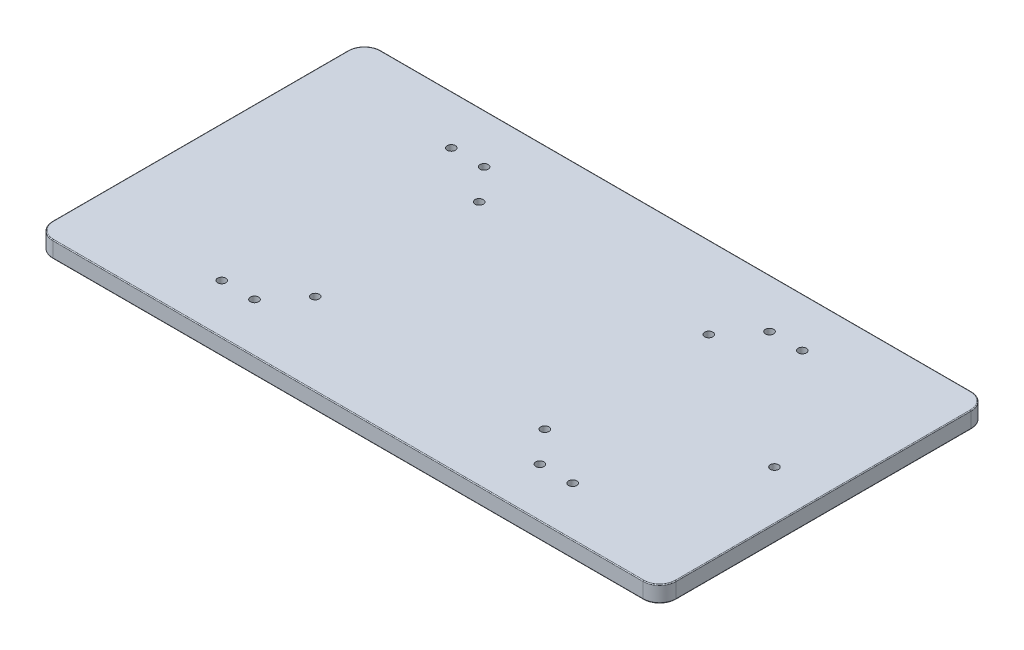
ISO-10303-21;
HEADER;
FILE_DESCRIPTION(('STEP AP214'),'2;1');
FILE_NAME('part.step','',(''),(''),'','','');
FILE_SCHEMA(('AUTOMOTIVE_DESIGN { 1 0 10303 214 1 1 1 1 }'));
ENDSEC;
DATA;
#1=APPLICATION_CONTEXT('core data for automotive mechanical design processes');
#2=APPLICATION_PROTOCOL_DEFINITION('international standard','automotive_design',2000,#1);
#3=PRODUCT_CONTEXT('',#1,'mechanical');
#4=PRODUCT('Part','Part','',(#3));
#5=PRODUCT_RELATED_PRODUCT_CATEGORY('part','',(#4));
#6=PRODUCT_DEFINITION_FORMATION('','',#4);
#7=PRODUCT_DEFINITION_CONTEXT('part definition',#1,'design');
#8=PRODUCT_DEFINITION('design','',#6,#7);
#9=PRODUCT_DEFINITION_SHAPE('','',#8);
#10=(LENGTH_UNIT() NAMED_UNIT(*) SI_UNIT(.MILLI.,.METRE.));
#11=(NAMED_UNIT(*) PLANE_ANGLE_UNIT() SI_UNIT($,.RADIAN.));
#12=(NAMED_UNIT(*) SI_UNIT($,.STERADIAN.) SOLID_ANGLE_UNIT());
#13=UNCERTAINTY_MEASURE_WITH_UNIT(LENGTH_MEASURE(1.E-05),#10,'distance_accuracy_value','');
#14=(GEOMETRIC_REPRESENTATION_CONTEXT(3) GLOBAL_UNCERTAINTY_ASSIGNED_CONTEXT((#13)) GLOBAL_UNIT_ASSIGNED_CONTEXT((#10,
#11,#12)) REPRESENTATION_CONTEXT('',''));
#15=CARTESIAN_POINT('',(0.,0.,0.));
#16=DIRECTION('',(0.,0.,1.));
#17=DIRECTION('',(1.,0.,0.));
#18=AXIS2_PLACEMENT_3D('',#15,#16,#17);
#19=CARTESIAN_POINT('',(0.,5.,-50.));
#20=DIRECTION('',(0.,0.,1.));
#21=DIRECTION('',(1.,0.,0.));
#22=AXIS2_PLACEMENT_3D('',#19,#20,#21);
#23=PLANE('',#22);
#24=DIRECTION('',(0.,-1.,0.));
#25=VECTOR('',#24,1.);
#26=CARTESIAN_POINT('',(90.,0.,-50.));
#27=LINE('',#26,#25);
#28=CARTESIAN_POINT('',(90.,4.75,-50.));
#29=VERTEX_POINT('',#28);
#30=CARTESIAN_POINT('',(90.,0.25,-50.));
#31=VERTEX_POINT('',#30);
#32=EDGE_CURVE('E296',#29,#31,#27,.T.);
#33=ORIENTED_EDGE('',*,*,#32,.T.);
#34=DIRECTION('',(-1.,0.,0.));
#35=VECTOR('',#34,1.);
#36=CARTESIAN_POINT('',(0.,0.25,-50.));
#37=LINE('',#36,#35);
#38=CARTESIAN_POINT('',(-90.,0.25,-50.));
#39=VERTEX_POINT('',#38);
#40=EDGE_CURVE('E206',#31,#39,#37,.T.);
#41=ORIENTED_EDGE('',*,*,#40,.T.);
#42=DIRECTION('',(0.,-1.,0.));
#43=VECTOR('',#42,1.);
#44=CARTESIAN_POINT('',(-90.,5.,-50.));
#45=LINE('',#44,#43);
#46=CARTESIAN_POINT('',(-90.,4.75,-50.));
#47=VERTEX_POINT('',#46);
#48=EDGE_CURVE('E289',#39,#47,#45,.F.);
#49=ORIENTED_EDGE('',*,*,#48,.T.);
#50=DIRECTION('',(-1.,0.,0.));
#51=VECTOR('',#50,1.);
#52=CARTESIAN_POINT('',(90.,4.75,-50.));
#53=LINE('',#52,#51);
#54=EDGE_CURVE('E204',#47,#29,#53,.F.);
#55=ORIENTED_EDGE('',*,*,#54,.T.);
#56=EDGE_LOOP('',(#33,#41,#49,#55));
#57=FACE_BOUND('',#56,.T.);
#58=ADVANCED_FACE('F44',(#57),#23,.F.);
#59=CARTESIAN_POINT('',(-95.,5.,0.));
#60=DIRECTION('',(1.,0.,0.));
#61=DIRECTION('',(0.,0.,-1.));
#62=AXIS2_PLACEMENT_3D('',#59,#60,#61);
#63=PLANE('',#62);
#64=DIRECTION('',(0.,-1.,0.));
#65=VECTOR('',#64,1.);
#66=CARTESIAN_POINT('',(-95.,5.,-45.));
#67=LINE('',#66,#65);
#68=CARTESIAN_POINT('',(-95.,4.75,-45.));
#69=VERTEX_POINT('',#68);
#70=CARTESIAN_POINT('',(-95.,0.25,-45.));
#71=VERTEX_POINT('',#70);
#72=EDGE_CURVE('E180',#69,#71,#67,.T.);
#73=ORIENTED_EDGE('',*,*,#72,.T.);
#74=DIRECTION('',(0.,0.,1.));
#75=VECTOR('',#74,1.);
#76=CARTESIAN_POINT('',(-95.,0.25,0.));
#77=LINE('',#76,#75);
#78=CARTESIAN_POINT('',(-95.,0.25,45.));
#79=VERTEX_POINT('',#78);
#80=EDGE_CURVE('E214',#71,#79,#77,.T.);
#81=ORIENTED_EDGE('',*,*,#80,.T.);
#82=DIRECTION('',(0.,-1.,0.));
#83=VECTOR('',#82,1.);
#84=CARTESIAN_POINT('',(-95.,5.,45.));
#85=LINE('',#84,#83);
#86=CARTESIAN_POINT('',(-95.,4.75,45.));
#87=VERTEX_POINT('',#86);
#88=EDGE_CURVE('E319',#79,#87,#85,.F.);
#89=ORIENTED_EDGE('',*,*,#88,.T.);
#90=DIRECTION('',(0.,0.,1.));
#91=VECTOR('',#90,1.);
#92=CARTESIAN_POINT('',(-95.,4.75,-45.));
#93=LINE('',#92,#91);
#94=EDGE_CURVE('E212',#87,#69,#93,.F.);
#95=ORIENTED_EDGE('',*,*,#94,.T.);
#96=EDGE_LOOP('',(#73,#81,#89,#95));
#97=FACE_BOUND('',#96,.T.);
#98=ADVANCED_FACE('F389',(#97),#63,.F.);
#99=CARTESIAN_POINT('',(0.,5.,50.));
#100=DIRECTION('',(0.,0.,1.));
#101=DIRECTION('',(1.,0.,0.));
#102=AXIS2_PLACEMENT_3D('',#99,#100,#101);
#103=PLANE('',#102);
#104=DIRECTION('',(0.,-1.,0.));
#105=VECTOR('',#104,1.);
#106=CARTESIAN_POINT('',(-90.,0.,50.));
#107=LINE('',#106,#105);
#108=CARTESIAN_POINT('',(-90.,4.75,50.));
#109=VERTEX_POINT('',#108);
#110=CARTESIAN_POINT('',(-90.,0.25,50.));
#111=VERTEX_POINT('',#110);
#112=EDGE_CURVE('E313',#109,#111,#107,.T.);
#113=ORIENTED_EDGE('',*,*,#112,.T.);
#114=DIRECTION('',(-1.,0.,0.));
#115=VECTOR('',#114,1.);
#116=CARTESIAN_POINT('',(90.,0.25,50.));
#117=LINE('',#116,#115);
#118=CARTESIAN_POINT('',(90.,0.25,50.));
#119=VERTEX_POINT('',#118);
#120=EDGE_CURVE('E11',#111,#119,#117,.F.);
#121=ORIENTED_EDGE('',*,*,#120,.T.);
#122=DIRECTION('',(0.,-1.,0.));
#123=VECTOR('',#122,1.);
#124=CARTESIAN_POINT('',(90.,5.,50.));
#125=LINE('',#124,#123);
#126=CARTESIAN_POINT('',(90.,4.75,50.));
#127=VERTEX_POINT('',#126);
#128=EDGE_CURVE('E316',#119,#127,#125,.F.);
#129=ORIENTED_EDGE('',*,*,#128,.T.);
#130=DIRECTION('',(-1.,0.,0.));
#131=VECTOR('',#130,1.);
#132=CARTESIAN_POINT('',(0.,4.75,50.));
#133=LINE('',#132,#131);
#134=EDGE_CURVE('E53',#127,#109,#133,.T.);
#135=ORIENTED_EDGE('',*,*,#134,.T.);
#136=EDGE_LOOP('',(#113,#121,#129,#135));
#137=FACE_BOUND('',#136,.T.);
#138=ADVANCED_FACE('F361',(#137),#103,.T.);
#139=CARTESIAN_POINT('',(35.,5.,-25.));
#140=DIRECTION('',(0.,-1.,0.));
#141=DIRECTION('',(0.,0.,-1.));
#142=AXIS2_PLACEMENT_3D('',#139,#140,#141);
#143=CYLINDRICAL_SURFACE('',#142,1.25);
#144=CARTESIAN_POINT('',(35.,0.,-25.));
#145=DIRECTION('',(0.,1.,0.));
#146=DIRECTION('',(0.,0.,1.));
#147=AXIS2_PLACEMENT_3D('',#144,#145,#146);
#148=CIRCLE('',#147,1.25);
#149=CARTESIAN_POINT('',(35.,0.,-23.75));
#150=VERTEX_POINT('',#149);
#151=EDGE_CURVE('E842',#150,#150,#148,.T.);
#152=ORIENTED_EDGE('',*,*,#151,.F.);
#153=EDGE_LOOP('',(#152));
#154=FACE_BOUND('',#153,.T.);
#155=CARTESIAN_POINT('',(35.,5.,-25.));
#156=DIRECTION('',(0.,1.,0.));
#157=DIRECTION('',(0.,0.,1.));
#158=AXIS2_PLACEMENT_3D('',#155,#156,#157);
#159=CIRCLE('',#158,1.25);
#160=CARTESIAN_POINT('',(35.,5.,-23.75));
#161=VERTEX_POINT('',#160);
#162=EDGE_CURVE('E875',#161,#161,#159,.T.);
#163=ORIENTED_EDGE('',*,*,#162,.T.);
#164=EDGE_LOOP('',(#163));
#165=FACE_BOUND('',#164,.T.);
#166=ADVANCED_FACE('F410',(#154,#165),#143,.F.);
#167=CARTESIAN_POINT('',(35.,5.,25.));
#168=DIRECTION('',(0.,-1.,0.));
#169=DIRECTION('',(0.,0.,-1.));
#170=AXIS2_PLACEMENT_3D('',#167,#168,#169);
#171=CYLINDRICAL_SURFACE('',#170,1.25);
#172=CARTESIAN_POINT('',(35.,0.,25.));
#173=DIRECTION('',(0.,1.,0.));
#174=DIRECTION('',(0.,0.,1.));
#175=AXIS2_PLACEMENT_3D('',#172,#173,#174);
#176=CIRCLE('',#175,1.25);
#177=CARTESIAN_POINT('',(35.,0.,26.25));
#178=VERTEX_POINT('',#177);
#179=EDGE_CURVE('E839',#178,#178,#176,.T.);
#180=ORIENTED_EDGE('',*,*,#179,.F.);
#181=EDGE_LOOP('',(#180));
#182=FACE_BOUND('',#181,.T.);
#183=CARTESIAN_POINT('',(35.,5.,25.));
#184=DIRECTION('',(0.,1.,0.));
#185=DIRECTION('',(0.,0.,1.));
#186=AXIS2_PLACEMENT_3D('',#183,#184,#185);
#187=CIRCLE('',#186,1.25);
#188=CARTESIAN_POINT('',(35.,5.,26.25));
#189=VERTEX_POINT('',#188);
#190=EDGE_CURVE('E872',#189,#189,#187,.T.);
#191=ORIENTED_EDGE('',*,*,#190,.T.);
#192=EDGE_LOOP('',(#191));
#193=FACE_BOUND('',#192,.T.);
#194=ADVANCED_FACE('F406',(#182,#193),#171,.F.);
#195=CARTESIAN_POINT('',(-35.,5.,25.));
#196=DIRECTION('',(0.,-1.,0.));
#197=DIRECTION('',(0.,0.,-1.));
#198=AXIS2_PLACEMENT_3D('',#195,#196,#197);
#199=CYLINDRICAL_SURFACE('',#198,1.25);
#200=CARTESIAN_POINT('',(-35.,0.,25.));
#201=DIRECTION('',(0.,1.,0.));
#202=DIRECTION('',(0.,0.,1.));
#203=AXIS2_PLACEMENT_3D('',#200,#201,#202);
#204=CIRCLE('',#203,1.25);
#205=CARTESIAN_POINT('',(-35.,0.,26.25));
#206=VERTEX_POINT('',#205);
#207=EDGE_CURVE('E834',#206,#206,#204,.T.);
#208=ORIENTED_EDGE('',*,*,#207,.F.);
#209=EDGE_LOOP('',(#208));
#210=FACE_BOUND('',#209,.T.);
#211=CARTESIAN_POINT('',(-35.,5.,25.));
#212=DIRECTION('',(0.,1.,0.));
#213=DIRECTION('',(0.,0.,1.));
#214=AXIS2_PLACEMENT_3D('',#211,#212,#213);
#215=CIRCLE('',#214,1.25);
#216=CARTESIAN_POINT('',(-35.,5.,26.25));
#217=VERTEX_POINT('',#216);
#218=EDGE_CURVE('E869',#217,#217,#215,.T.);
#219=ORIENTED_EDGE('',*,*,#218,.T.);
#220=EDGE_LOOP('',(#219));
#221=FACE_BOUND('',#220,.T.);
#222=ADVANCED_FACE('F402',(#210,#221),#199,.F.);
#223=CARTESIAN_POINT('',(-35.,5.,-25.));
#224=DIRECTION('',(0.,-1.,0.));
#225=DIRECTION('',(0.,0.,-1.));
#226=AXIS2_PLACEMENT_3D('',#223,#224,#225);
#227=CYLINDRICAL_SURFACE('',#226,1.25);
#228=CARTESIAN_POINT('',(-35.,0.,-25.));
#229=DIRECTION('',(0.,1.,0.));
#230=DIRECTION('',(0.,0.,1.));
#231=AXIS2_PLACEMENT_3D('',#228,#229,#230);
#232=CIRCLE('',#231,1.25);
#233=CARTESIAN_POINT('',(-35.,0.,-23.75));
#234=VERTEX_POINT('',#233);
#235=EDGE_CURVE('E830',#234,#234,#232,.T.);
#236=ORIENTED_EDGE('',*,*,#235,.F.);
#237=EDGE_LOOP('',(#236));
#238=FACE_BOUND('',#237,.T.);
#239=CARTESIAN_POINT('',(-35.,5.,-25.));
#240=DIRECTION('',(0.,1.,0.));
#241=DIRECTION('',(0.,0.,1.));
#242=AXIS2_PLACEMENT_3D('',#239,#240,#241);
#243=CIRCLE('',#242,1.25);
#244=CARTESIAN_POINT('',(-35.,5.,-23.75));
#245=VERTEX_POINT('',#244);
#246=EDGE_CURVE('E866',#245,#245,#243,.T.);
#247=ORIENTED_EDGE('',*,*,#246,.T.);
#248=EDGE_LOOP('',(#247));
#249=FACE_BOUND('',#248,.T.);
#250=ADVANCED_FACE('F398',(#238,#249),#227,.F.);
#251=CARTESIAN_POINT('',(-43.5,5.,-35.));
#252=DIRECTION('',(0.,-1.,0.));
#253=DIRECTION('',(0.,0.,-1.));
#254=AXIS2_PLACEMENT_3D('',#251,#252,#253);
#255=CYLINDRICAL_SURFACE('',#254,1.25);
#256=CARTESIAN_POINT('',(-43.5,5.,-35.));
#257=DIRECTION('',(0.,1.,0.));
#258=DIRECTION('',(0.,0.,1.));
#259=AXIS2_PLACEMENT_3D('',#256,#257,#258);
#260=CIRCLE('',#259,1.25);
#261=CARTESIAN_POINT('',(-43.5,5.,-33.75));
#262=VERTEX_POINT('',#261);
#263=EDGE_CURVE('E302',#262,#262,#260,.F.);
#264=ORIENTED_EDGE('',*,*,#263,.F.);
#265=EDGE_LOOP('',(#264));
#266=FACE_BOUND('',#265,.T.);
#267=CARTESIAN_POINT('',(-43.5,0.,-35.));
#268=DIRECTION('',(0.,1.,0.));
#269=DIRECTION('',(0.,0.,1.));
#270=AXIS2_PLACEMENT_3D('',#267,#268,#269);
#271=CIRCLE('',#270,1.25);
#272=CARTESIAN_POINT('',(-43.5,0.,-33.75));
#273=VERTEX_POINT('',#272);
#274=EDGE_CURVE('E828',#273,#273,#271,.F.);
#275=ORIENTED_EDGE('',*,*,#274,.T.);
#276=EDGE_LOOP('',(#275));
#277=FACE_BOUND('',#276,.T.);
#278=ADVANCED_FACE('F401',(#266,#277),#255,.F.);
#279=CARTESIAN_POINT('',(95.,5.,0.));
#280=DIRECTION('',(1.,0.,0.));
#281=DIRECTION('',(0.,0.,-1.));
#282=AXIS2_PLACEMENT_3D('',#279,#280,#281);
#283=PLANE('',#282);
#284=DIRECTION('',(0.,-1.,0.));
#285=VECTOR('',#284,1.);
#286=CARTESIAN_POINT('',(95.,5.,45.));
#287=LINE('',#286,#285);
#288=CARTESIAN_POINT('',(95.,4.75,45.));
#289=VERTEX_POINT('',#288);
#290=CARTESIAN_POINT('',(95.,0.25,45.));
#291=VERTEX_POINT('',#290);
#292=EDGE_CURVE('E299',#289,#291,#287,.T.);
#293=ORIENTED_EDGE('',*,*,#292,.T.);
#294=DIRECTION('',(0.,0.,1.));
#295=VECTOR('',#294,1.);
#296=CARTESIAN_POINT('',(95.,0.25,-45.));
#297=LINE('',#296,#295);
#298=CARTESIAN_POINT('',(95.,0.25,-45.));
#299=VERTEX_POINT('',#298);
#300=EDGE_CURVE('E198',#291,#299,#297,.F.);
#301=ORIENTED_EDGE('',*,*,#300,.T.);
#302=DIRECTION('',(0.,-1.,0.));
#303=VECTOR('',#302,1.);
#304=CARTESIAN_POINT('',(95.,5.,-45.));
#305=LINE('',#304,#303);
#306=CARTESIAN_POINT('',(95.,4.75,-45.));
#307=VERTEX_POINT('',#306);
#308=EDGE_CURVE('E310',#299,#307,#305,.F.);
#309=ORIENTED_EDGE('',*,*,#308,.T.);
#310=DIRECTION('',(0.,0.,1.));
#311=VECTOR('',#310,1.);
#312=CARTESIAN_POINT('',(95.,4.75,0.));
#313=LINE('',#312,#311);
#314=EDGE_CURVE('E196',#307,#289,#313,.T.);
#315=ORIENTED_EDGE('',*,*,#314,.T.);
#316=EDGE_LOOP('',(#293,#301,#309,#315));
#317=FACE_BOUND('',#316,.T.);
#318=ADVANCED_FACE('F345',(#317),#283,.T.);
#319=CARTESIAN_POINT('',(80.,5.,0.));
#320=DIRECTION('',(0.,-1.,0.));
#321=DIRECTION('',(0.,0.,-1.));
#322=AXIS2_PLACEMENT_3D('',#319,#320,#321);
#323=CYLINDRICAL_SURFACE('',#322,1.25);
#324=CARTESIAN_POINT('',(80.,5.,0.));
#325=DIRECTION('',(0.,1.,0.));
#326=DIRECTION('',(0.,0.,1.));
#327=AXIS2_PLACEMENT_3D('',#324,#325,#326);
#328=CIRCLE('',#327,1.25);
#329=CARTESIAN_POINT('',(80.,5.,1.24999999999998));
#330=VERTEX_POINT('',#329);
#331=EDGE_CURVE('E878',#330,#330,#328,.T.);
#332=ORIENTED_EDGE('',*,*,#331,.T.);
#333=EDGE_LOOP('',(#332));
#334=FACE_BOUND('',#333,.T.);
#335=CARTESIAN_POINT('',(80.,0.,0.));
#336=DIRECTION('',(0.,1.,0.));
#337=DIRECTION('',(0.,0.,1.));
#338=AXIS2_PLACEMENT_3D('',#335,#336,#337);
#339=CIRCLE('',#338,1.25);
#340=CARTESIAN_POINT('',(80.,0.,1.24999999999998));
#341=VERTEX_POINT('',#340);
#342=EDGE_CURVE('E845',#341,#341,#339,.T.);
#343=ORIENTED_EDGE('',*,*,#342,.F.);
#344=EDGE_LOOP('',(#343));
#345=FACE_BOUND('',#344,.T.);
#346=ADVANCED_FACE('F415',(#334,#345),#323,.F.);
#347=CARTESIAN_POINT('',(-43.5,5.,35.));
#348=DIRECTION('',(0.,-1.,0.));
#349=DIRECTION('',(0.,0.,-1.));
#350=AXIS2_PLACEMENT_3D('',#347,#348,#349);
#351=CYLINDRICAL_SURFACE('',#350,1.25);
#352=CARTESIAN_POINT('',(-43.5,5.,35.));
#353=DIRECTION('',(0.,1.,0.));
#354=DIRECTION('',(0.,0.,1.));
#355=AXIS2_PLACEMENT_3D('',#352,#353,#354);
#356=CIRCLE('',#355,1.25);
#357=CARTESIAN_POINT('',(-43.5,5.,36.25));
#358=VERTEX_POINT('',#357);
#359=EDGE_CURVE('E881',#358,#358,#356,.T.);
#360=ORIENTED_EDGE('',*,*,#359,.T.);
#361=EDGE_LOOP('',(#360));
#362=FACE_BOUND('',#361,.T.);
#363=CARTESIAN_POINT('',(-43.5,0.,35.));
#364=DIRECTION('',(0.,1.,0.));
#365=DIRECTION('',(0.,0.,1.));
#366=AXIS2_PLACEMENT_3D('',#363,#364,#365);
#367=CIRCLE('',#366,1.25);
#368=CARTESIAN_POINT('',(-43.5,0.,36.25));
#369=VERTEX_POINT('',#368);
#370=EDGE_CURVE('E848',#369,#369,#367,.T.);
#371=ORIENTED_EDGE('',*,*,#370,.F.);
#372=EDGE_LOOP('',(#371));
#373=FACE_BOUND('',#372,.T.);
#374=ADVANCED_FACE('F418',(#362,#373),#351,.F.);
#375=CARTESIAN_POINT('',(-53.5,5.,35.));
#376=DIRECTION('',(0.,-1.,0.));
#377=DIRECTION('',(0.,0.,-1.));
#378=AXIS2_PLACEMENT_3D('',#375,#376,#377);
#379=CYLINDRICAL_SURFACE('',#378,1.25);
#380=CARTESIAN_POINT('',(-53.5,5.,35.));
#381=DIRECTION('',(0.,1.,0.));
#382=DIRECTION('',(0.,0.,1.));
#383=AXIS2_PLACEMENT_3D('',#380,#381,#382);
#384=CIRCLE('',#383,1.25);
#385=CARTESIAN_POINT('',(-53.5,5.,36.25));
#386=VERTEX_POINT('',#385);
#387=EDGE_CURVE('E884',#386,#386,#384,.T.);
#388=ORIENTED_EDGE('',*,*,#387,.T.);
#389=EDGE_LOOP('',(#388));
#390=FACE_BOUND('',#389,.T.);
#391=CARTESIAN_POINT('',(-53.5,0.,35.));
#392=DIRECTION('',(0.,1.,0.));
#393=DIRECTION('',(0.,0.,1.));
#394=AXIS2_PLACEMENT_3D('',#391,#392,#393);
#395=CIRCLE('',#394,1.25);
#396=CARTESIAN_POINT('',(-53.5,0.,36.25));
#397=VERTEX_POINT('',#396);
#398=EDGE_CURVE('E851',#397,#397,#395,.T.);
#399=ORIENTED_EDGE('',*,*,#398,.F.);
#400=EDGE_LOOP('',(#399));
#401=FACE_BOUND('',#400,.T.);
#402=ADVANCED_FACE('F422',(#390,#401),#379,.F.);
#403=CARTESIAN_POINT('',(-53.5,5.,-35.));
#404=DIRECTION('',(0.,-1.,0.));
#405=DIRECTION('',(0.,0.,-1.));
#406=AXIS2_PLACEMENT_3D('',#403,#404,#405);
#407=CYLINDRICAL_SURFACE('',#406,1.25);
#408=CARTESIAN_POINT('',(-53.5,5.,-35.));
#409=DIRECTION('',(0.,1.,0.));
#410=DIRECTION('',(0.,0.,1.));
#411=AXIS2_PLACEMENT_3D('',#408,#409,#410);
#412=CIRCLE('',#411,1.25);
#413=CARTESIAN_POINT('',(-53.5,5.,-33.75));
#414=VERTEX_POINT('',#413);
#415=EDGE_CURVE('E887',#414,#414,#412,.F.);
#416=ORIENTED_EDGE('',*,*,#415,.F.);
#417=EDGE_LOOP('',(#416));
#418=FACE_BOUND('',#417,.T.);
#419=CARTESIAN_POINT('',(-53.5,0.,-35.));
#420=DIRECTION('',(0.,1.,0.));
#421=DIRECTION('',(0.,0.,1.));
#422=AXIS2_PLACEMENT_3D('',#419,#420,#421);
#423=CIRCLE('',#422,1.25);
#424=CARTESIAN_POINT('',(-53.5,0.,-33.75));
#425=VERTEX_POINT('',#424);
#426=EDGE_CURVE('E854',#425,#425,#423,.F.);
#427=ORIENTED_EDGE('',*,*,#426,.T.);
#428=EDGE_LOOP('',(#427));
#429=FACE_BOUND('',#428,.T.);
#430=ADVANCED_FACE('F426',(#418,#429),#407,.F.);
#431=CARTESIAN_POINT('',(53.5,5.,-35.));
#432=DIRECTION('',(0.,-1.,0.));
#433=DIRECTION('',(0.,0.,-1.));
#434=AXIS2_PLACEMENT_3D('',#431,#432,#433);
#435=CYLINDRICAL_SURFACE('',#434,1.25);
#436=CARTESIAN_POINT('',(53.5,5.,-35.));
#437=DIRECTION('',(0.,1.,0.));
#438=DIRECTION('',(0.,0.,1.));
#439=AXIS2_PLACEMENT_3D('',#436,#437,#438);
#440=CIRCLE('',#439,1.25);
#441=CARTESIAN_POINT('',(53.5,5.,-33.75));
#442=VERTEX_POINT('',#441);
#443=EDGE_CURVE('E890',#442,#442,#440,.T.);
#444=ORIENTED_EDGE('',*,*,#443,.T.);
#445=EDGE_LOOP('',(#444));
#446=FACE_BOUND('',#445,.T.);
#447=CARTESIAN_POINT('',(53.5,0.,-35.));
#448=DIRECTION('',(0.,1.,0.));
#449=DIRECTION('',(0.,0.,1.));
#450=AXIS2_PLACEMENT_3D('',#447,#448,#449);
#451=CIRCLE('',#450,1.25);
#452=CARTESIAN_POINT('',(53.5,0.,-33.75));
#453=VERTEX_POINT('',#452);
#454=EDGE_CURVE('E857',#453,#453,#451,.T.);
#455=ORIENTED_EDGE('',*,*,#454,.F.);
#456=EDGE_LOOP('',(#455));
#457=FACE_BOUND('',#456,.T.);
#458=ADVANCED_FACE('F430',(#446,#457),#435,.F.);
#459=CARTESIAN_POINT('',(43.5,5.,-35.));
#460=DIRECTION('',(0.,-1.,0.));
#461=DIRECTION('',(0.,0.,-1.));
#462=AXIS2_PLACEMENT_3D('',#459,#460,#461);
#463=CYLINDRICAL_SURFACE('',#462,1.25);
#464=CARTESIAN_POINT('',(43.5,5.,-35.));
#465=DIRECTION('',(0.,1.,0.));
#466=DIRECTION('',(0.,0.,1.));
#467=AXIS2_PLACEMENT_3D('',#464,#465,#466);
#468=CIRCLE('',#467,1.25);
#469=CARTESIAN_POINT('',(43.5,5.,-33.75));
#470=VERTEX_POINT('',#469);
#471=EDGE_CURVE('E893',#470,#470,#468,.T.);
#472=ORIENTED_EDGE('',*,*,#471,.T.);
#473=EDGE_LOOP('',(#472));
#474=FACE_BOUND('',#473,.T.);
#475=CARTESIAN_POINT('',(43.5,0.,-35.));
#476=DIRECTION('',(0.,1.,0.));
#477=DIRECTION('',(0.,0.,1.));
#478=AXIS2_PLACEMENT_3D('',#475,#476,#477);
#479=CIRCLE('',#478,1.25);
#480=CARTESIAN_POINT('',(43.5,0.,-33.75));
#481=VERTEX_POINT('',#480);
#482=EDGE_CURVE('E860',#481,#481,#479,.T.);
#483=ORIENTED_EDGE('',*,*,#482,.F.);
#484=EDGE_LOOP('',(#483));
#485=FACE_BOUND('',#484,.T.);
#486=ADVANCED_FACE('F434',(#474,#485),#463,.F.);
#487=CARTESIAN_POINT('',(43.5,5.,35.));
#488=DIRECTION('',(0.,-1.,0.));
#489=DIRECTION('',(0.,0.,-1.));
#490=AXIS2_PLACEMENT_3D('',#487,#488,#489);
#491=CYLINDRICAL_SURFACE('',#490,1.25);
#492=CARTESIAN_POINT('',(43.5,5.,35.));
#493=DIRECTION('',(0.,1.,0.));
#494=DIRECTION('',(0.,0.,1.));
#495=AXIS2_PLACEMENT_3D('',#492,#493,#494);
#496=CIRCLE('',#495,1.25);
#497=CARTESIAN_POINT('',(43.5,5.,36.25));
#498=VERTEX_POINT('',#497);
#499=EDGE_CURVE('E832',#498,#498,#496,.F.);
#500=ORIENTED_EDGE('',*,*,#499,.F.);
#501=EDGE_LOOP('',(#500));
#502=FACE_BOUND('',#501,.T.);
#503=CARTESIAN_POINT('',(43.5,0.,35.));
#504=DIRECTION('',(0.,1.,0.));
#505=DIRECTION('',(0.,0.,1.));
#506=AXIS2_PLACEMENT_3D('',#503,#504,#505);
#507=CIRCLE('',#506,1.25);
#508=CARTESIAN_POINT('',(43.5,0.,36.25));
#509=VERTEX_POINT('',#508);
#510=EDGE_CURVE('E253',#509,#509,#507,.F.);
#511=ORIENTED_EDGE('',*,*,#510,.T.);
#512=EDGE_LOOP('',(#511));
#513=FACE_BOUND('',#512,.T.);
#514=ADVANCED_FACE('F438',(#502,#513),#491,.F.);
#515=CARTESIAN_POINT('',(53.5,5.,35.));
#516=DIRECTION('',(0.,-1.,0.));
#517=DIRECTION('',(0.,0.,-1.));
#518=AXIS2_PLACEMENT_3D('',#515,#516,#517);
#519=CYLINDRICAL_SURFACE('',#518,1.25);
#520=CARTESIAN_POINT('',(53.5,5.,35.));
#521=DIRECTION('',(0.,1.,0.));
#522=DIRECTION('',(0.,0.,1.));
#523=AXIS2_PLACEMENT_3D('',#520,#521,#522);
#524=CIRCLE('',#523,1.25);
#525=CARTESIAN_POINT('',(53.5,5.,36.25));
#526=VERTEX_POINT('',#525);
#527=EDGE_CURVE('E297',#526,#526,#524,.F.);
#528=ORIENTED_EDGE('',*,*,#527,.F.);
#529=EDGE_LOOP('',(#528));
#530=FACE_BOUND('',#529,.T.);
#531=CARTESIAN_POINT('',(53.5,0.,35.));
#532=DIRECTION('',(0.,1.,0.));
#533=DIRECTION('',(0.,0.,1.));
#534=AXIS2_PLACEMENT_3D('',#531,#532,#533);
#535=CIRCLE('',#534,1.25);
#536=CARTESIAN_POINT('',(53.5,0.,36.25));
#537=VERTEX_POINT('',#536);
#538=EDGE_CURVE('E305',#537,#537,#535,.F.);
#539=ORIENTED_EDGE('',*,*,#538,.T.);
#540=EDGE_LOOP('',(#539));
#541=FACE_BOUND('',#540,.T.);
#542=ADVANCED_FACE('F442',(#530,#541),#519,.F.);
#543=CARTESIAN_POINT('',(0.,5.,0.));
#544=DIRECTION('',(0.,1.,0.));
#545=DIRECTION('',(0.,0.,1.));
#546=AXIS2_PLACEMENT_3D('',#543,#544,#545);
#547=PLANE('',#546);
#548=ORIENTED_EDGE('',*,*,#246,.F.);
#549=EDGE_LOOP('',(#548));
#550=FACE_BOUND('',#549,.T.);
#551=ORIENTED_EDGE('',*,*,#218,.F.);
#552=EDGE_LOOP('',(#551));
#553=FACE_BOUND('',#552,.T.);
#554=ORIENTED_EDGE('',*,*,#162,.F.);
#555=EDGE_LOOP('',(#554));
#556=FACE_BOUND('',#555,.T.);
#557=DIRECTION('',(-1.,0.,0.));
#558=VECTOR('',#557,1.);
#559=CARTESIAN_POINT('',(0.,5.,49.75));
#560=LINE('',#559,#558);
#561=CARTESIAN_POINT('',(-90.,5.,49.75));
#562=VERTEX_POINT('',#561);
#563=CARTESIAN_POINT('',(90.,5.,49.75));
#564=VERTEX_POINT('',#563);
#565=EDGE_CURVE('E220',#562,#564,#560,.F.);
#566=ORIENTED_EDGE('',*,*,#565,.T.);
#567=CARTESIAN_POINT('',(90.,5.,45.));
#568=DIRECTION('',(0.,1.,0.));
#569=DIRECTION('',(0.,0.,1.));
#570=AXIS2_PLACEMENT_3D('',#567,#568,#569);
#571=CIRCLE('',#570,4.75);
#572=CARTESIAN_POINT('',(94.75,5.,45.));
#573=VERTEX_POINT('',#572);
#574=EDGE_CURVE('E233',#564,#573,#571,.T.);
#575=ORIENTED_EDGE('',*,*,#574,.T.);
#576=DIRECTION('',(0.,0.,1.));
#577=VECTOR('',#576,1.);
#578=CARTESIAN_POINT('',(94.75,5.,0.));
#579=LINE('',#578,#577);
#580=CARTESIAN_POINT('',(94.75,5.,-45.));
#581=VERTEX_POINT('',#580);
#582=EDGE_CURVE('E68',#573,#581,#579,.F.);
#583=ORIENTED_EDGE('',*,*,#582,.T.);
#584=CARTESIAN_POINT('',(90.,5.,-45.));
#585=DIRECTION('',(0.,1.,0.));
#586=DIRECTION('',(0.,0.,1.));
#587=AXIS2_PLACEMENT_3D('',#584,#585,#586);
#588=CIRCLE('',#587,4.75);
#589=CARTESIAN_POINT('',(90.,5.,-49.75));
#590=VERTEX_POINT('',#589);
#591=EDGE_CURVE('E230',#581,#590,#588,.T.);
#592=ORIENTED_EDGE('',*,*,#591,.T.);
#593=DIRECTION('',(-1.,0.,0.));
#594=VECTOR('',#593,1.);
#595=CARTESIAN_POINT('',(-90.,5.,-49.75));
#596=LINE('',#595,#594);
#597=CARTESIAN_POINT('',(-90.,5.,-49.75));
#598=VERTEX_POINT('',#597);
#599=EDGE_CURVE('E228',#590,#598,#596,.T.);
#600=ORIENTED_EDGE('',*,*,#599,.T.);
#601=CARTESIAN_POINT('',(-90.,5.,-45.));
#602=DIRECTION('',(0.,1.,0.));
#603=DIRECTION('',(0.,0.,1.));
#604=AXIS2_PLACEMENT_3D('',#601,#602,#603);
#605=CIRCLE('',#604,4.75);
#606=CARTESIAN_POINT('',(-94.75,5.,-45.));
#607=VERTEX_POINT('',#606);
#608=EDGE_CURVE('E226',#598,#607,#605,.T.);
#609=ORIENTED_EDGE('',*,*,#608,.T.);
#610=DIRECTION('',(0.,0.,1.));
#611=VECTOR('',#610,1.);
#612=CARTESIAN_POINT('',(-94.75,5.,45.));
#613=LINE('',#612,#611);
#614=CARTESIAN_POINT('',(-94.75,5.,45.));
#615=VERTEX_POINT('',#614);
#616=EDGE_CURVE('E224',#607,#615,#613,.T.);
#617=ORIENTED_EDGE('',*,*,#616,.T.);
#618=CARTESIAN_POINT('',(-90.,5.,45.));
#619=DIRECTION('',(0.,1.,0.));
#620=DIRECTION('',(0.,0.,1.));
#621=AXIS2_PLACEMENT_3D('',#618,#619,#620);
#622=CIRCLE('',#621,4.75);
#623=EDGE_CURVE('E222',#615,#562,#622,.T.);
#624=ORIENTED_EDGE('',*,*,#623,.T.);
#625=EDGE_LOOP('',(#566,#575,#583,#592,#600,#609,#617,#624));
#626=FACE_BOUND('',#625,.T.);
#627=ORIENTED_EDGE('',*,*,#499,.T.);
#628=EDGE_LOOP('',(#627));
#629=FACE_BOUND('',#628,.T.);
#630=ORIENTED_EDGE('',*,*,#471,.F.);
#631=EDGE_LOOP('',(#630));
#632=FACE_BOUND('',#631,.T.);
#633=ORIENTED_EDGE('',*,*,#443,.F.);
#634=EDGE_LOOP('',(#633));
#635=FACE_BOUND('',#634,.T.);
#636=ORIENTED_EDGE('',*,*,#415,.T.);
#637=EDGE_LOOP('',(#636));
#638=FACE_BOUND('',#637,.T.);
#639=ORIENTED_EDGE('',*,*,#387,.F.);
#640=EDGE_LOOP('',(#639));
#641=FACE_BOUND('',#640,.T.);
#642=ORIENTED_EDGE('',*,*,#359,.F.);
#643=EDGE_LOOP('',(#642));
#644=FACE_BOUND('',#643,.T.);
#645=ORIENTED_EDGE('',*,*,#331,.F.);
#646=EDGE_LOOP('',(#645));
#647=FACE_BOUND('',#646,.T.);
#648=ORIENTED_EDGE('',*,*,#190,.F.);
#649=EDGE_LOOP('',(#648));
#650=FACE_BOUND('',#649,.T.);
#651=ORIENTED_EDGE('',*,*,#263,.T.);
#652=EDGE_LOOP('',(#651));
#653=FACE_BOUND('',#652,.T.);
#654=ORIENTED_EDGE('',*,*,#527,.T.);
#655=EDGE_LOOP('',(#654));
#656=FACE_BOUND('',#655,.T.);
#657=ADVANCED_FACE('F350',(#550,#553,#556,#626,#629,#632,#635,#638,#641,#644,#647,#650,#653,
#656),#547,.T.);
#658=CARTESIAN_POINT('',(0.,0.,0.));
#659=DIRECTION('',(0.,1.,0.));
#660=DIRECTION('',(0.,0.,1.));
#661=AXIS2_PLACEMENT_3D('',#658,#659,#660);
#662=PLANE('',#661);
#663=ORIENTED_EDGE('',*,*,#235,.T.);
#664=EDGE_LOOP('',(#663));
#665=FACE_BOUND('',#664,.T.);
#666=ORIENTED_EDGE('',*,*,#207,.T.);
#667=EDGE_LOOP('',(#666));
#668=FACE_BOUND('',#667,.T.);
#669=ORIENTED_EDGE('',*,*,#151,.T.);
#670=EDGE_LOOP('',(#669));
#671=FACE_BOUND('',#670,.T.);
#672=DIRECTION('',(0.,0.,1.));
#673=VECTOR('',#672,1.);
#674=CARTESIAN_POINT('',(94.75,0.,45.));
#675=LINE('',#674,#673);
#676=CARTESIAN_POINT('',(94.75,0.,-45.));
#677=VERTEX_POINT('',#676);
#678=CARTESIAN_POINT('',(94.75,0.,45.));
#679=VERTEX_POINT('',#678);
#680=EDGE_CURVE('E185',#677,#679,#675,.T.);
#681=ORIENTED_EDGE('',*,*,#680,.T.);
#682=CARTESIAN_POINT('',(90.,0.,45.));
#683=DIRECTION('',(0.,1.,0.));
#684=DIRECTION('',(0.,0.,1.));
#685=AXIS2_PLACEMENT_3D('',#682,#683,#684);
#686=CIRCLE('',#685,4.75);
#687=CARTESIAN_POINT('',(90.,0.,49.75));
#688=VERTEX_POINT('',#687);
#689=EDGE_CURVE('E165',#679,#688,#686,.F.);
#690=ORIENTED_EDGE('',*,*,#689,.T.);
#691=DIRECTION('',(-1.,0.,0.));
#692=VECTOR('',#691,1.);
#693=CARTESIAN_POINT('',(-90.,0.,49.75));
#694=LINE('',#693,#692);
#695=CARTESIAN_POINT('',(-90.,0.,49.75));
#696=VERTEX_POINT('',#695);
#697=EDGE_CURVE('E173',#688,#696,#694,.T.);
#698=ORIENTED_EDGE('',*,*,#697,.T.);
#699=CARTESIAN_POINT('',(-90.,0.,45.));
#700=DIRECTION('',(0.,1.,0.));
#701=DIRECTION('',(0.,0.,1.));
#702=AXIS2_PLACEMENT_3D('',#699,#700,#701);
#703=CIRCLE('',#702,4.75);
#704=CARTESIAN_POINT('',(-94.75,0.,45.));
#705=VERTEX_POINT('',#704);
#706=EDGE_CURVE('E179',#696,#705,#703,.F.);
#707=ORIENTED_EDGE('',*,*,#706,.T.);
#708=DIRECTION('',(0.,0.,1.));
#709=VECTOR('',#708,1.);
#710=CARTESIAN_POINT('',(-94.75,0.,0.));
#711=LINE('',#710,#709);
#712=CARTESIAN_POINT('',(-94.75,0.,-45.));
#713=VERTEX_POINT('',#712);
#714=EDGE_CURVE('E324',#705,#713,#711,.F.);
#715=ORIENTED_EDGE('',*,*,#714,.T.);
#716=CARTESIAN_POINT('',(-90.,0.,-45.));
#717=DIRECTION('',(0.,1.,0.));
#718=DIRECTION('',(0.,0.,1.));
#719=AXIS2_PLACEMENT_3D('',#716,#717,#718);
#720=CIRCLE('',#719,4.75);
#721=CARTESIAN_POINT('',(-90.,0.,-49.75));
#722=VERTEX_POINT('',#721);
#723=EDGE_CURVE('E326',#713,#722,#720,.F.);
#724=ORIENTED_EDGE('',*,*,#723,.T.);
#725=DIRECTION('',(-1.,0.,0.));
#726=VECTOR('',#725,1.);
#727=CARTESIAN_POINT('',(0.,0.,-49.75));
#728=LINE('',#727,#726);
#729=CARTESIAN_POINT('',(90.,0.,-49.75));
#730=VERTEX_POINT('',#729);
#731=EDGE_CURVE('E328',#722,#730,#728,.F.);
#732=ORIENTED_EDGE('',*,*,#731,.T.);
#733=CARTESIAN_POINT('',(90.,0.,-45.));
#734=DIRECTION('',(0.,1.,0.));
#735=DIRECTION('',(0.,0.,1.));
#736=AXIS2_PLACEMENT_3D('',#733,#734,#735);
#737=CIRCLE('',#736,4.75);
#738=EDGE_CURVE('E191',#730,#677,#737,.F.);
#739=ORIENTED_EDGE('',*,*,#738,.T.);
#740=EDGE_LOOP('',(#681,#690,#698,#707,#715,#724,#732,#739));
#741=FACE_BOUND('',#740,.T.);
#742=ORIENTED_EDGE('',*,*,#510,.F.);
#743=EDGE_LOOP('',(#742));
#744=FACE_BOUND('',#743,.T.);
#745=ORIENTED_EDGE('',*,*,#482,.T.);
#746=EDGE_LOOP('',(#745));
#747=FACE_BOUND('',#746,.T.);
#748=ORIENTED_EDGE('',*,*,#454,.T.);
#749=EDGE_LOOP('',(#748));
#750=FACE_BOUND('',#749,.T.);
#751=ORIENTED_EDGE('',*,*,#426,.F.);
#752=EDGE_LOOP('',(#751));
#753=FACE_BOUND('',#752,.T.);
#754=ORIENTED_EDGE('',*,*,#398,.T.);
#755=EDGE_LOOP('',(#754));
#756=FACE_BOUND('',#755,.T.);
#757=ORIENTED_EDGE('',*,*,#370,.T.);
#758=EDGE_LOOP('',(#757));
#759=FACE_BOUND('',#758,.T.);
#760=ORIENTED_EDGE('',*,*,#342,.T.);
#761=EDGE_LOOP('',(#760));
#762=FACE_BOUND('',#761,.T.);
#763=ORIENTED_EDGE('',*,*,#179,.T.);
#764=EDGE_LOOP('',(#763));
#765=FACE_BOUND('',#764,.T.);
#766=ORIENTED_EDGE('',*,*,#274,.F.);
#767=EDGE_LOOP('',(#766));
#768=FACE_BOUND('',#767,.T.);
#769=ORIENTED_EDGE('',*,*,#538,.F.);
#770=EDGE_LOOP('',(#769));
#771=FACE_BOUND('',#770,.T.);
#772=ADVANCED_FACE('F182',(#665,#668,#671,#741,#744,#747,#750,#753,#756,#759,#762,#765,#768,
#771),#662,.F.);
#773=CARTESIAN_POINT('',(90.,5.,-45.));
#774=DIRECTION('',(0.,1.,0.));
#775=DIRECTION('',(0.,0.,1.));
#776=AXIS2_PLACEMENT_3D('',#773,#774,#775);
#777=CYLINDRICAL_SURFACE('',#776,5.);
#778=ORIENTED_EDGE('',*,*,#308,.F.);
#779=CARTESIAN_POINT('',(90.,0.25,-45.));
#780=DIRECTION('',(0.,1.,0.));
#781=DIRECTION('',(0.,0.,1.));
#782=AXIS2_PLACEMENT_3D('',#779,#780,#781);
#783=CIRCLE('',#782,5.);
#784=EDGE_CURVE('E202',#299,#31,#783,.T.);
#785=ORIENTED_EDGE('',*,*,#784,.T.);
#786=ORIENTED_EDGE('',*,*,#32,.F.);
#787=CARTESIAN_POINT('',(90.,4.75,-45.));
#788=DIRECTION('',(0.,1.,0.));
#789=DIRECTION('',(0.,0.,1.));
#790=AXIS2_PLACEMENT_3D('',#787,#788,#789);
#791=CIRCLE('',#790,5.);
#792=EDGE_CURVE('E200',#29,#307,#791,.F.);
#793=ORIENTED_EDGE('',*,*,#792,.T.);
#794=EDGE_LOOP('',(#778,#785,#786,#793));
#795=FACE_BOUND('',#794,.T.);
#796=ADVANCED_FACE('F444',(#795),#777,.T.);
#797=CARTESIAN_POINT('',(90.,5.,45.));
#798=DIRECTION('',(0.,-1.,0.));
#799=DIRECTION('',(0.,0.,-1.));
#800=AXIS2_PLACEMENT_3D('',#797,#798,#799);
#801=CYLINDRICAL_SURFACE('',#800,5.);
#802=ORIENTED_EDGE('',*,*,#128,.F.);
#803=CARTESIAN_POINT('',(90.,0.25,45.));
#804=DIRECTION('',(0.,1.,0.));
#805=DIRECTION('',(0.,0.,1.));
#806=AXIS2_PLACEMENT_3D('',#803,#804,#805);
#807=CIRCLE('',#806,5.);
#808=EDGE_CURVE('E167',#119,#291,#807,.T.);
#809=ORIENTED_EDGE('',*,*,#808,.T.);
#810=ORIENTED_EDGE('',*,*,#292,.F.);
#811=CARTESIAN_POINT('',(90.,4.75,45.));
#812=DIRECTION('',(0.,1.,0.));
#813=DIRECTION('',(0.,0.,1.));
#814=AXIS2_PLACEMENT_3D('',#811,#812,#813);
#815=CIRCLE('',#814,5.);
#816=EDGE_CURVE('E187',#289,#127,#815,.F.);
#817=ORIENTED_EDGE('',*,*,#816,.T.);
#818=EDGE_LOOP('',(#802,#809,#810,#817));
#819=FACE_BOUND('',#818,.T.);
#820=ADVANCED_FACE('F344',(#819),#801,.T.);
#821=CARTESIAN_POINT('',(-90.,5.,-45.));
#822=DIRECTION('',(0.,-1.,0.));
#823=DIRECTION('',(0.,0.,-1.));
#824=AXIS2_PLACEMENT_3D('',#821,#822,#823);
#825=CYLINDRICAL_SURFACE('',#824,5.);
#826=ORIENTED_EDGE('',*,*,#48,.F.);
#827=CARTESIAN_POINT('',(-90.,0.25,-45.));
#828=DIRECTION('',(0.,1.,0.));
#829=DIRECTION('',(0.,0.,1.));
#830=AXIS2_PLACEMENT_3D('',#827,#828,#829);
#831=CIRCLE('',#830,5.);
#832=EDGE_CURVE('E210',#39,#71,#831,.T.);
#833=ORIENTED_EDGE('',*,*,#832,.T.);
#834=ORIENTED_EDGE('',*,*,#72,.F.);
#835=CARTESIAN_POINT('',(-90.,4.75,-45.));
#836=DIRECTION('',(0.,1.,0.));
#837=DIRECTION('',(0.,0.,1.));
#838=AXIS2_PLACEMENT_3D('',#835,#836,#837);
#839=CIRCLE('',#838,5.);
#840=EDGE_CURVE('E208',#69,#47,#839,.F.);
#841=ORIENTED_EDGE('',*,*,#840,.T.);
#842=EDGE_LOOP('',(#826,#833,#834,#841));
#843=FACE_BOUND('',#842,.T.);
#844=ADVANCED_FACE('F288',(#843),#825,.T.);
#845=CARTESIAN_POINT('',(-90.,5.,45.));
#846=DIRECTION('',(0.,1.,0.));
#847=DIRECTION('',(0.,0.,1.));
#848=AXIS2_PLACEMENT_3D('',#845,#846,#847);
#849=CYLINDRICAL_SURFACE('',#848,5.);
#850=ORIENTED_EDGE('',*,*,#88,.F.);
#851=CARTESIAN_POINT('',(-90.,0.25,45.));
#852=DIRECTION('',(0.,1.,0.));
#853=DIRECTION('',(0.,0.,1.));
#854=AXIS2_PLACEMENT_3D('',#851,#852,#853);
#855=CIRCLE('',#854,5.);
#856=EDGE_CURVE('E218',#79,#111,#855,.T.);
#857=ORIENTED_EDGE('',*,*,#856,.T.);
#858=ORIENTED_EDGE('',*,*,#112,.F.);
#859=CARTESIAN_POINT('',(-90.,4.75,45.));
#860=DIRECTION('',(0.,1.,0.));
#861=DIRECTION('',(0.,0.,1.));
#862=AXIS2_PLACEMENT_3D('',#859,#860,#861);
#863=CIRCLE('',#862,5.);
#864=EDGE_CURVE('E216',#109,#87,#863,.F.);
#865=ORIENTED_EDGE('',*,*,#864,.T.);
#866=EDGE_LOOP('',(#850,#857,#858,#865));
#867=FACE_BOUND('',#866,.T.);
#868=ADVANCED_FACE('F386',(#867),#849,.T.);
#869=CARTESIAN_POINT('',(-90.,0.25,-45.));
#870=DIRECTION('',(0.,1.,0.));
#871=DIRECTION('',(0.,0.,1.));
#872=AXIS2_PLACEMENT_3D('',#869,#870,#871);
#873=TOROIDAL_SURFACE('',#872,4.75,0.25);
#874=CARTESIAN_POINT('',(-94.75,0.25,-45.));
#875=DIRECTION('',(0.,0.,1.));
#876=DIRECTION('',(1.,0.,0.));
#877=AXIS2_PLACEMENT_3D('',#874,#875,#876);
#878=CIRCLE('',#877,0.25);
#879=EDGE_CURVE('E247',#71,#713,#878,.T.);
#880=ORIENTED_EDGE('',*,*,#879,.F.);
#881=ORIENTED_EDGE('',*,*,#832,.F.);
#882=CARTESIAN_POINT('',(-90.,0.25,-49.75));
#883=DIRECTION('',(1.,0.,0.));
#884=DIRECTION('',(0.,0.,-1.));
#885=AXIS2_PLACEMENT_3D('',#882,#883,#884);
#886=CIRCLE('',#885,0.25);
#887=EDGE_CURVE('E250',#722,#39,#886,.T.);
#888=ORIENTED_EDGE('',*,*,#887,.F.);
#889=ORIENTED_EDGE('',*,*,#723,.F.);
#890=EDGE_LOOP('',(#880,#881,#888,#889));
#891=FACE_BOUND('',#890,.T.);
#892=ADVANCED_FACE('F375',(#891),#873,.T.);
#893=CARTESIAN_POINT('',(0.,0.25,-49.75));
#894=DIRECTION('',(-1.,0.,0.));
#895=DIRECTION('',(0.,0.,1.));
#896=AXIS2_PLACEMENT_3D('',#893,#894,#895);
#897=CYLINDRICAL_SURFACE('',#896,0.25);
#898=ORIENTED_EDGE('',*,*,#887,.T.);
#899=ORIENTED_EDGE('',*,*,#40,.F.);
#900=CARTESIAN_POINT('',(90.,0.25,-49.75));
#901=DIRECTION('',(1.,0.,0.));
#902=DIRECTION('',(0.,0.,-1.));
#903=AXIS2_PLACEMENT_3D('',#900,#901,#902);
#904=CIRCLE('',#903,0.25);
#905=EDGE_CURVE('E244',#730,#31,#904,.T.);
#906=ORIENTED_EDGE('',*,*,#905,.F.);
#907=ORIENTED_EDGE('',*,*,#731,.F.);
#908=EDGE_LOOP('',(#898,#899,#906,#907));
#909=FACE_BOUND('',#908,.T.);
#910=ADVANCED_FACE('F378',(#909),#897,.T.);
#911=CARTESIAN_POINT('',(-94.75,0.25,0.));
#912=DIRECTION('',(0.,0.,1.));
#913=DIRECTION('',(1.,0.,0.));
#914=AXIS2_PLACEMENT_3D('',#911,#912,#913);
#915=CYLINDRICAL_SURFACE('',#914,0.25);
#916=ORIENTED_EDGE('',*,*,#879,.T.);
#917=ORIENTED_EDGE('',*,*,#714,.F.);
#918=CARTESIAN_POINT('',(-94.75,0.25,45.));
#919=DIRECTION('',(0.,0.,1.));
#920=DIRECTION('',(1.,0.,0.));
#921=AXIS2_PLACEMENT_3D('',#918,#919,#920);
#922=CIRCLE('',#921,0.25);
#923=EDGE_CURVE('E241',#79,#705,#922,.T.);
#924=ORIENTED_EDGE('',*,*,#923,.F.);
#925=ORIENTED_EDGE('',*,*,#80,.F.);
#926=EDGE_LOOP('',(#916,#917,#924,#925));
#927=FACE_BOUND('',#926,.T.);
#928=ADVANCED_FACE('F371',(#927),#915,.T.);
#929=CARTESIAN_POINT('',(90.,0.25,-45.));
#930=DIRECTION('',(0.,1.,0.));
#931=DIRECTION('',(0.,0.,1.));
#932=AXIS2_PLACEMENT_3D('',#929,#930,#931);
#933=TOROIDAL_SURFACE('',#932,4.75,0.25);
#934=ORIENTED_EDGE('',*,*,#905,.T.);
#935=ORIENTED_EDGE('',*,*,#784,.F.);
#936=CARTESIAN_POINT('',(94.75,0.25,-45.));
#937=DIRECTION('',(0.,0.,1.));
#938=DIRECTION('',(1.,0.,0.));
#939=AXIS2_PLACEMENT_3D('',#936,#937,#938);
#940=CIRCLE('',#939,0.25);
#941=EDGE_CURVE('E238',#677,#299,#940,.T.);
#942=ORIENTED_EDGE('',*,*,#941,.F.);
#943=ORIENTED_EDGE('',*,*,#738,.F.);
#944=EDGE_LOOP('',(#934,#935,#942,#943));
#945=FACE_BOUND('',#944,.T.);
#946=ADVANCED_FACE('F335',(#945),#933,.T.);
#947=CARTESIAN_POINT('',(-90.,0.25,45.));
#948=DIRECTION('',(0.,1.,0.));
#949=DIRECTION('',(0.,0.,1.));
#950=AXIS2_PLACEMENT_3D('',#947,#948,#949);
#951=TOROIDAL_SURFACE('',#950,4.75,0.25);
#952=ORIENTED_EDGE('',*,*,#923,.T.);
#953=ORIENTED_EDGE('',*,*,#706,.F.);
#954=CARTESIAN_POINT('',(-90.,0.25,49.75));
#955=DIRECTION('',(1.,0.,0.));
#956=DIRECTION('',(0.,0.,-1.));
#957=AXIS2_PLACEMENT_3D('',#954,#955,#956);
#958=CIRCLE('',#957,0.25);
#959=EDGE_CURVE('E176',#111,#696,#958,.T.);
#960=ORIENTED_EDGE('',*,*,#959,.F.);
#961=ORIENTED_EDGE('',*,*,#856,.F.);
#962=EDGE_LOOP('',(#952,#953,#960,#961));
#963=FACE_BOUND('',#962,.T.);
#964=ADVANCED_FACE('F366',(#963),#951,.T.);
#965=CARTESIAN_POINT('',(94.75,0.25,0.));
#966=DIRECTION('',(0.,0.,-1.));
#967=DIRECTION('',(-1.,0.,0.));
#968=AXIS2_PLACEMENT_3D('',#965,#966,#967);
#969=CYLINDRICAL_SURFACE('',#968,0.25);
#970=ORIENTED_EDGE('',*,*,#941,.T.);
#971=ORIENTED_EDGE('',*,*,#300,.F.);
#972=CARTESIAN_POINT('',(94.75,0.25,45.));
#973=DIRECTION('',(0.,0.,1.));
#974=DIRECTION('',(1.,0.,0.));
#975=AXIS2_PLACEMENT_3D('',#972,#973,#974);
#976=CIRCLE('',#975,0.25);
#977=EDGE_CURVE('E170',#679,#291,#976,.T.);
#978=ORIENTED_EDGE('',*,*,#977,.F.);
#979=ORIENTED_EDGE('',*,*,#680,.F.);
#980=EDGE_LOOP('',(#970,#971,#978,#979));
#981=FACE_BOUND('',#980,.T.);
#982=ADVANCED_FACE('F338',(#981),#969,.T.);
#983=CARTESIAN_POINT('',(0.,0.25,49.75));
#984=DIRECTION('',(1.,0.,0.));
#985=DIRECTION('',(0.,0.,-1.));
#986=AXIS2_PLACEMENT_3D('',#983,#984,#985);
#987=CYLINDRICAL_SURFACE('',#986,0.25);
#988=ORIENTED_EDGE('',*,*,#959,.T.);
#989=ORIENTED_EDGE('',*,*,#697,.F.);
#990=CARTESIAN_POINT('',(90.,0.25,49.75));
#991=DIRECTION('',(1.,0.,0.));
#992=DIRECTION('',(0.,0.,-1.));
#993=AXIS2_PLACEMENT_3D('',#990,#991,#992);
#994=CIRCLE('',#993,0.25);
#995=EDGE_CURVE('E161',#119,#688,#994,.T.);
#996=ORIENTED_EDGE('',*,*,#995,.F.);
#997=ORIENTED_EDGE('',*,*,#120,.F.);
#998=EDGE_LOOP('',(#988,#989,#996,#997));
#999=FACE_BOUND('',#998,.T.);
#1000=ADVANCED_FACE('F174',(#999),#987,.T.);
#1001=CARTESIAN_POINT('',(90.,0.25,45.));
#1002=DIRECTION('',(0.,1.,0.));
#1003=DIRECTION('',(0.,0.,1.));
#1004=AXIS2_PLACEMENT_3D('',#1001,#1002,#1003);
#1005=TOROIDAL_SURFACE('',#1004,4.75,0.25);
#1006=ORIENTED_EDGE('',*,*,#977,.T.);
#1007=ORIENTED_EDGE('',*,*,#808,.F.);
#1008=ORIENTED_EDGE('',*,*,#995,.T.);
#1009=ORIENTED_EDGE('',*,*,#689,.F.);
#1010=EDGE_LOOP('',(#1006,#1007,#1008,#1009));
#1011=FACE_BOUND('',#1010,.T.);
#1012=ADVANCED_FACE('F163',(#1011),#1005,.T.);
#1013=CARTESIAN_POINT('',(-90.,4.75,-45.));
#1014=DIRECTION('',(0.,1.,0.));
#1015=DIRECTION('',(0.,0.,1.));
#1016=AXIS2_PLACEMENT_3D('',#1013,#1014,#1015);
#1017=TOROIDAL_SURFACE('',#1016,4.75,0.25);
#1018=CARTESIAN_POINT('',(-90.,4.75,-49.75));
#1019=DIRECTION('',(1.,0.,0.));
#1020=DIRECTION('',(0.,0.,-1.));
#1021=AXIS2_PLACEMENT_3D('',#1018,#1019,#1020);
#1022=CIRCLE('',#1021,0.25);
#1023=EDGE_CURVE('E268',#47,#598,#1022,.T.);
#1024=ORIENTED_EDGE('',*,*,#1023,.F.);
#1025=ORIENTED_EDGE('',*,*,#840,.F.);
#1026=CARTESIAN_POINT('',(-94.75,4.75,-45.));
#1027=DIRECTION('',(0.,0.,1.));
#1028=DIRECTION('',(1.,0.,0.));
#1029=AXIS2_PLACEMENT_3D('',#1026,#1027,#1028);
#1030=CIRCLE('',#1029,0.25);
#1031=EDGE_CURVE('E48',#607,#69,#1030,.T.);
#1032=ORIENTED_EDGE('',*,*,#1031,.F.);
#1033=ORIENTED_EDGE('',*,*,#608,.F.);
#1034=EDGE_LOOP('',(#1024,#1025,#1032,#1033));
#1035=FACE_BOUND('',#1034,.T.);
#1036=ADVANCED_FACE('F46',(#1035),#1017,.T.);
#1037=CARTESIAN_POINT('',(-94.75,4.75,0.));
#1038=DIRECTION('',(0.,0.,-1.));
#1039=DIRECTION('',(-1.,0.,0.));
#1040=AXIS2_PLACEMENT_3D('',#1037,#1038,#1039);
#1041=CYLINDRICAL_SURFACE('',#1040,0.25);
#1042=ORIENTED_EDGE('',*,*,#1031,.T.);
#1043=ORIENTED_EDGE('',*,*,#94,.F.);
#1044=CARTESIAN_POINT('',(-94.75,4.75,45.));
#1045=DIRECTION('',(0.,0.,1.));
#1046=DIRECTION('',(1.,0.,0.));
#1047=AXIS2_PLACEMENT_3D('',#1044,#1045,#1046);
#1048=CIRCLE('',#1047,0.25);
#1049=EDGE_CURVE('E266',#615,#87,#1048,.T.);
#1050=ORIENTED_EDGE('',*,*,#1049,.F.);
#1051=ORIENTED_EDGE('',*,*,#616,.F.);
#1052=EDGE_LOOP('',(#1042,#1043,#1050,#1051));
#1053=FACE_BOUND('',#1052,.T.);
#1054=ADVANCED_FACE('F279',(#1053),#1041,.T.);
#1055=CARTESIAN_POINT('',(0.,4.75,-49.75));
#1056=DIRECTION('',(1.,0.,0.));
#1057=DIRECTION('',(0.,0.,-1.));
#1058=AXIS2_PLACEMENT_3D('',#1055,#1056,#1057);
#1059=CYLINDRICAL_SURFACE('',#1058,0.25);
#1060=ORIENTED_EDGE('',*,*,#1023,.T.);
#1061=ORIENTED_EDGE('',*,*,#599,.F.);
#1062=CARTESIAN_POINT('',(90.,4.75,-49.75));
#1063=DIRECTION('',(1.,0.,0.));
#1064=DIRECTION('',(0.,0.,-1.));
#1065=AXIS2_PLACEMENT_3D('',#1062,#1063,#1064);
#1066=CIRCLE('',#1065,0.25);
#1067=EDGE_CURVE('E263',#29,#590,#1066,.T.);
#1068=ORIENTED_EDGE('',*,*,#1067,.F.);
#1069=ORIENTED_EDGE('',*,*,#54,.F.);
#1070=EDGE_LOOP('',(#1060,#1061,#1068,#1069));
#1071=FACE_BOUND('',#1070,.T.);
#1072=ADVANCED_FACE('F494',(#1071),#1059,.T.);
#1073=CARTESIAN_POINT('',(-90.,4.75,45.));
#1074=DIRECTION('',(0.,1.,0.));
#1075=DIRECTION('',(0.,0.,1.));
#1076=AXIS2_PLACEMENT_3D('',#1073,#1074,#1075);
#1077=TOROIDAL_SURFACE('',#1076,4.75,0.25);
#1078=ORIENTED_EDGE('',*,*,#1049,.T.);
#1079=ORIENTED_EDGE('',*,*,#864,.F.);
#1080=CARTESIAN_POINT('',(-90.,4.75,49.75));
#1081=DIRECTION('',(1.,0.,0.));
#1082=DIRECTION('',(0.,0.,-1.));
#1083=AXIS2_PLACEMENT_3D('',#1080,#1081,#1082);
#1084=CIRCLE('',#1083,0.25);
#1085=EDGE_CURVE('E260',#562,#109,#1084,.T.);
#1086=ORIENTED_EDGE('',*,*,#1085,.F.);
#1087=ORIENTED_EDGE('',*,*,#623,.F.);
#1088=EDGE_LOOP('',(#1078,#1079,#1086,#1087));
#1089=FACE_BOUND('',#1088,.T.);
#1090=ADVANCED_FACE('F500',(#1089),#1077,.T.);
#1091=CARTESIAN_POINT('',(90.,4.75,-45.));
#1092=DIRECTION('',(0.,1.,0.));
#1093=DIRECTION('',(0.,0.,1.));
#1094=AXIS2_PLACEMENT_3D('',#1091,#1092,#1093);
#1095=TOROIDAL_SURFACE('',#1094,4.75,0.25);
#1096=ORIENTED_EDGE('',*,*,#1067,.T.);
#1097=ORIENTED_EDGE('',*,*,#591,.F.);
#1098=CARTESIAN_POINT('',(94.75,4.75,-45.));
#1099=DIRECTION('',(0.,0.,1.));
#1100=DIRECTION('',(1.,0.,0.));
#1101=AXIS2_PLACEMENT_3D('',#1098,#1099,#1100);
#1102=CIRCLE('',#1101,0.25);
#1103=EDGE_CURVE('E257',#307,#581,#1102,.T.);
#1104=ORIENTED_EDGE('',*,*,#1103,.F.);
#1105=ORIENTED_EDGE('',*,*,#792,.F.);
#1106=EDGE_LOOP('',(#1096,#1097,#1104,#1105));
#1107=FACE_BOUND('',#1106,.T.);
#1108=ADVANCED_FACE('F507',(#1107),#1095,.T.);
#1109=CARTESIAN_POINT('',(0.,4.75,49.75));
#1110=DIRECTION('',(-1.,0.,0.));
#1111=DIRECTION('',(0.,0.,1.));
#1112=AXIS2_PLACEMENT_3D('',#1109,#1110,#1111);
#1113=CYLINDRICAL_SURFACE('',#1112,0.25);
#1114=ORIENTED_EDGE('',*,*,#1085,.T.);
#1115=ORIENTED_EDGE('',*,*,#134,.F.);
#1116=CARTESIAN_POINT('',(90.,4.75,49.75));
#1117=DIRECTION('',(1.,0.,0.));
#1118=DIRECTION('',(0.,0.,-1.));
#1119=AXIS2_PLACEMENT_3D('',#1116,#1117,#1118);
#1120=CIRCLE('',#1119,0.25);
#1121=EDGE_CURVE('E255',#564,#127,#1120,.T.);
#1122=ORIENTED_EDGE('',*,*,#1121,.F.);
#1123=ORIENTED_EDGE('',*,*,#565,.F.);
#1124=EDGE_LOOP('',(#1114,#1115,#1122,#1123));
#1125=FACE_BOUND('',#1124,.T.);
#1126=ADVANCED_FACE('F357',(#1125),#1113,.T.);
#1127=CARTESIAN_POINT('',(94.75,4.75,0.));
#1128=DIRECTION('',(0.,0.,1.));
#1129=DIRECTION('',(1.,0.,0.));
#1130=AXIS2_PLACEMENT_3D('',#1127,#1128,#1129);
#1131=CYLINDRICAL_SURFACE('',#1130,0.25);
#1132=ORIENTED_EDGE('',*,*,#1103,.T.);
#1133=ORIENTED_EDGE('',*,*,#582,.F.);
#1134=CARTESIAN_POINT('',(94.75,4.75,45.));
#1135=DIRECTION('',(0.,0.,1.));
#1136=DIRECTION('',(1.,0.,0.));
#1137=AXIS2_PLACEMENT_3D('',#1134,#1135,#1136);
#1138=CIRCLE('',#1137,0.25);
#1139=EDGE_CURVE('E61',#289,#573,#1138,.T.);
#1140=ORIENTED_EDGE('',*,*,#1139,.F.);
#1141=ORIENTED_EDGE('',*,*,#314,.F.);
#1142=EDGE_LOOP('',(#1132,#1133,#1140,#1141));
#1143=FACE_BOUND('',#1142,.T.);
#1144=ADVANCED_FACE('F349',(#1143),#1131,.T.);
#1145=CARTESIAN_POINT('',(90.,4.75,45.));
#1146=DIRECTION('',(0.,1.,0.));
#1147=DIRECTION('',(0.,0.,1.));
#1148=AXIS2_PLACEMENT_3D('',#1145,#1146,#1147);
#1149=TOROIDAL_SURFACE('',#1148,4.75,0.25);
#1150=ORIENTED_EDGE('',*,*,#1121,.T.);
#1151=ORIENTED_EDGE('',*,*,#816,.F.);
#1152=ORIENTED_EDGE('',*,*,#1139,.T.);
#1153=ORIENTED_EDGE('',*,*,#574,.F.);
#1154=EDGE_LOOP('',(#1150,#1151,#1152,#1153));
#1155=FACE_BOUND('',#1154,.T.);
#1156=ADVANCED_FACE('F354',(#1155),#1149,.T.);
#1157=CLOSED_SHELL('',(#58,#98,#138,#166,#194,#222,#250,#278,#318,#346,#374,#402,#430,#458,#486,
#514,#542,#657,#772,#796,#820,#844,#868,#892,#910,#928,#946,#964,#982,#1000,#1012,#1036,#1054,
#1072,#1090,#1108,#1126,#1144,#1156));
#1158=MANIFOLD_SOLID_BREP('B2',#1157);
#1159=ADVANCED_BREP_SHAPE_REPRESENTATION('',(#18,#1158),#14);
#1160=SHAPE_DEFINITION_REPRESENTATION(#9,#1159);
ENDSEC;
END-ISO-10303-21;
